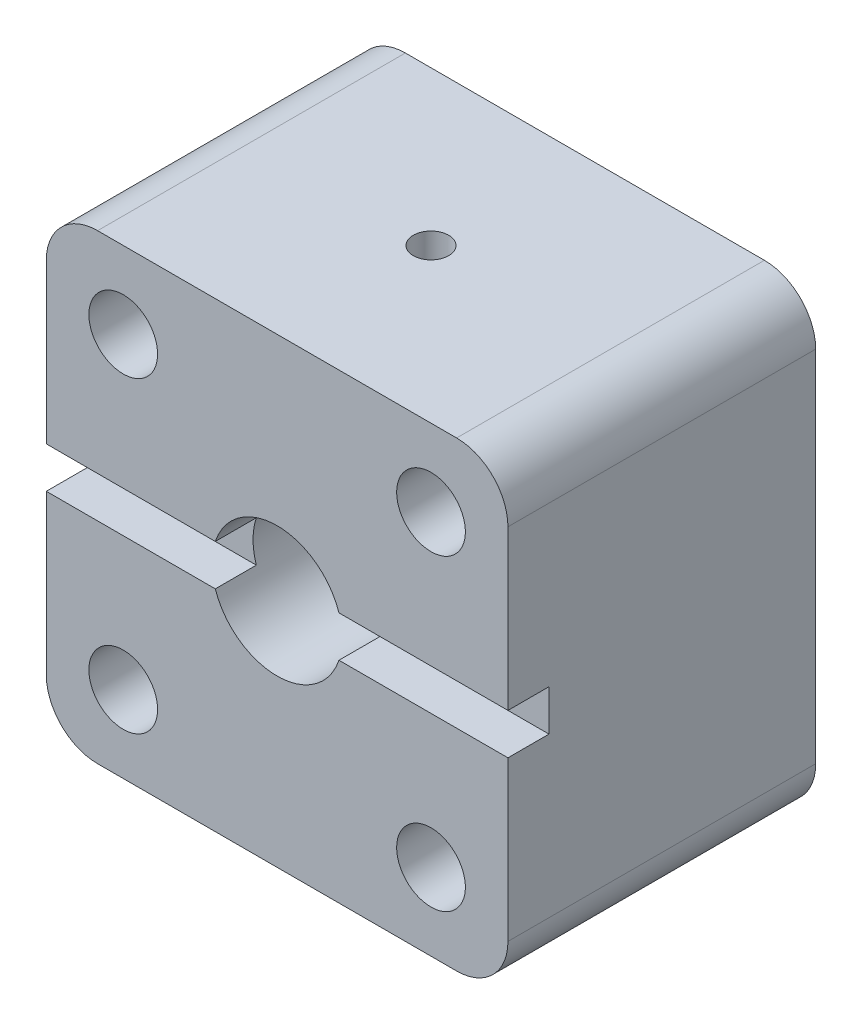
ISO-10303-21;
HEADER;
FILE_DESCRIPTION(('STEP AP214'),'2;1');
FILE_NAME('part.step','',(''),(''),'','','');
FILE_SCHEMA(('AUTOMOTIVE_DESIGN { 1 0 10303 214 1 1 1 1 }'));
ENDSEC;
DATA;
#1=APPLICATION_CONTEXT('core data for automotive mechanical design processes');
#2=APPLICATION_PROTOCOL_DEFINITION('international standard','automotive_design',2000,#1);
#3=PRODUCT_CONTEXT('',#1,'mechanical');
#4=PRODUCT('Part','Part','',(#3));
#5=PRODUCT_RELATED_PRODUCT_CATEGORY('part','',(#4));
#6=PRODUCT_DEFINITION_FORMATION('','',#4);
#7=PRODUCT_DEFINITION_CONTEXT('part definition',#1,'design');
#8=PRODUCT_DEFINITION('design','',#6,#7);
#9=PRODUCT_DEFINITION_SHAPE('','',#8);
#10=(LENGTH_UNIT() NAMED_UNIT(*) SI_UNIT(.MILLI.,.METRE.));
#11=(NAMED_UNIT(*) PLANE_ANGLE_UNIT() SI_UNIT($,.RADIAN.));
#12=(NAMED_UNIT(*) SI_UNIT($,.STERADIAN.) SOLID_ANGLE_UNIT());
#13=UNCERTAINTY_MEASURE_WITH_UNIT(LENGTH_MEASURE(1.E-05),#10,'distance_accuracy_value','');
#14=(GEOMETRIC_REPRESENTATION_CONTEXT(3) GLOBAL_UNCERTAINTY_ASSIGNED_CONTEXT((#13)) GLOBAL_UNIT_ASSIGNED_CONTEXT((#10,
#11,#12)) REPRESENTATION_CONTEXT('',''));
#15=CARTESIAN_POINT('',(0.,0.,0.));
#16=DIRECTION('',(0.,0.,1.));
#17=DIRECTION('',(1.,0.,0.));
#18=AXIS2_PLACEMENT_3D('',#15,#16,#17);
#19=CARTESIAN_POINT('',(0.,24.5,30.));
#20=DIRECTION('',(0.,1.,0.));
#21=DIRECTION('',(0.,0.,1.));
#22=AXIS2_PLACEMENT_3D('',#19,#20,#21);
#23=PLANE('',#22);
#24=DIRECTION('',(1.,0.,0.));
#25=VECTOR('',#24,1.);
#26=CARTESIAN_POINT('',(0.,24.5,30.));
#27=LINE('',#26,#25);
#28=CARTESIAN_POINT('',(28.5268150792935,24.5,30.));
#29=VERTEX_POINT('',#28);
#30=CARTESIAN_POINT('',(45.,24.5,30.));
#31=VERTEX_POINT('',#30);
#32=EDGE_CURVE('E182',#29,#31,#27,.T.);
#33=ORIENTED_EDGE('',*,*,#32,.F.);
#34=DIRECTION('',(0.,0.,-1.));
#35=VECTOR('',#34,1.);
#36=CARTESIAN_POINT('',(28.5268150792935,24.5,0.));
#37=LINE('',#36,#35);
#38=CARTESIAN_POINT('',(28.5268150792935,24.5,26.));
#39=VERTEX_POINT('',#38);
#40=EDGE_CURVE('E159',#29,#39,#37,.T.);
#41=ORIENTED_EDGE('',*,*,#40,.T.);
#42=DIRECTION('',(1.,0.,0.));
#43=VECTOR('',#42,1.);
#44=CARTESIAN_POINT('',(0.,24.5,26.));
#45=LINE('',#44,#43);
#46=CARTESIAN_POINT('',(45.,24.5,26.));
#47=VERTEX_POINT('',#46);
#48=EDGE_CURVE('E192',#39,#47,#45,.T.);
#49=ORIENTED_EDGE('',*,*,#48,.T.);
#50=DIRECTION('',(0.,0.,1.));
#51=VECTOR('',#50,1.);
#52=CARTESIAN_POINT('',(45.,24.5,30.));
#53=LINE('',#52,#51);
#54=EDGE_CURVE('E189',#47,#31,#53,.T.);
#55=ORIENTED_EDGE('',*,*,#54,.T.);
#56=EDGE_LOOP('',(#33,#41,#49,#55));
#57=FACE_BOUND('',#56,.T.);
#58=ADVANCED_FACE('F36',(#57),#23,.F.);
#59=CARTESIAN_POINT('',(0.,24.5,26.));
#60=DIRECTION('',(0.,0.,-1.));
#61=DIRECTION('',(0.,1.,0.));
#62=AXIS2_PLACEMENT_3D('',#59,#60,#61);
#63=PLANE('',#62);
#64=ORIENTED_EDGE('',*,*,#48,.F.);
#65=CARTESIAN_POINT('',(22.5,22.5,26.));
#66=DIRECTION('',(0.,0.,-1.));
#67=DIRECTION('',(0.,1.,0.));
#68=AXIS2_PLACEMENT_3D('',#65,#66,#67);
#69=CIRCLE('',#68,6.34999999999999);
#70=CARTESIAN_POINT('',(28.5268150792935,20.5,26.));
#71=VERTEX_POINT('',#70);
#72=EDGE_CURVE('E163',#39,#71,#69,.T.);
#73=ORIENTED_EDGE('',*,*,#72,.T.);
#74=DIRECTION('',(1.,0.,0.));
#75=VECTOR('',#74,1.);
#76=CARTESIAN_POINT('',(0.,20.5,26.));
#77=LINE('',#76,#75);
#78=CARTESIAN_POINT('',(45.,20.5,26.));
#79=VERTEX_POINT('',#78);
#80=EDGE_CURVE('E196',#71,#79,#77,.T.);
#81=ORIENTED_EDGE('',*,*,#80,.T.);
#82=DIRECTION('',(0.,1.,0.));
#83=VECTOR('',#82,1.);
#84=CARTESIAN_POINT('',(45.,24.5,26.));
#85=LINE('',#84,#83);
#86=EDGE_CURVE('E314',#79,#47,#85,.T.);
#87=ORIENTED_EDGE('',*,*,#86,.T.);
#88=EDGE_LOOP('',(#64,#73,#81,#87));
#89=FACE_BOUND('',#88,.T.);
#90=ADVANCED_FACE('F346',(#89),#63,.F.);
#91=CARTESIAN_POINT('',(0.,20.5,30.));
#92=DIRECTION('',(0.,-1.,0.));
#93=DIRECTION('',(0.,0.,-1.));
#94=AXIS2_PLACEMENT_3D('',#91,#92,#93);
#95=PLANE('',#94);
#96=DIRECTION('',(1.,0.,0.));
#97=VECTOR('',#96,1.);
#98=CARTESIAN_POINT('',(0.,20.5,30.));
#99=LINE('',#98,#97);
#100=CARTESIAN_POINT('',(0.,20.5,30.));
#101=VERTEX_POINT('',#100);
#102=CARTESIAN_POINT('',(16.4731849207065,20.5,30.));
#103=VERTEX_POINT('',#102);
#104=EDGE_CURVE('E197',#101,#103,#99,.T.);
#105=ORIENTED_EDGE('',*,*,#104,.T.);
#106=DIRECTION('',(0.,0.,-1.));
#107=VECTOR('',#106,1.);
#108=CARTESIAN_POINT('',(16.4731849207065,20.5,0.));
#109=LINE('',#108,#107);
#110=CARTESIAN_POINT('',(16.4731849207065,20.5,26.));
#111=VERTEX_POINT('',#110);
#112=EDGE_CURVE('E244',#103,#111,#109,.T.);
#113=ORIENTED_EDGE('',*,*,#112,.T.);
#114=CARTESIAN_POINT('',(0.,20.5,26.));
#115=VERTEX_POINT('',#114);
#116=EDGE_CURVE('E193',#115,#111,#77,.T.);
#117=ORIENTED_EDGE('',*,*,#116,.F.);
#118=DIRECTION('',(0.,0.,-1.));
#119=VECTOR('',#118,1.);
#120=CARTESIAN_POINT('',(0.,20.5,30.));
#121=LINE('',#120,#119);
#122=EDGE_CURVE('E308',#101,#115,#121,.T.);
#123=ORIENTED_EDGE('',*,*,#122,.F.);
#124=EDGE_LOOP('',(#105,#113,#117,#123));
#125=FACE_BOUND('',#124,.T.);
#126=ADVANCED_FACE('F340',(#125),#95,.F.);
#127=CARTESIAN_POINT('',(0.,0.,30.));
#128=DIRECTION('',(0.,0.,-1.));
#129=DIRECTION('',(-1.,0.,0.));
#130=AXIS2_PLACEMENT_3D('',#127,#128,#129);
#131=PLANE('',#130);
#132=CARTESIAN_POINT('',(37.5,37.5,30.));
#133=DIRECTION('',(0.,0.,-1.));
#134=DIRECTION('',(-1.,0.,0.));
#135=AXIS2_PLACEMENT_3D('',#132,#133,#134);
#136=CIRCLE('',#135,3.35);
#137=CARTESIAN_POINT('',(34.15,37.5,30.));
#138=VERTEX_POINT('',#137);
#139=EDGE_CURVE('E216',#138,#138,#136,.T.);
#140=ORIENTED_EDGE('',*,*,#139,.T.);
#141=EDGE_LOOP('',(#140));
#142=FACE_BOUND('',#141,.T.);
#143=CARTESIAN_POINT('',(7.50000000000001,37.5,30.));
#144=DIRECTION('',(0.,0.,-1.));
#145=DIRECTION('',(-1.,0.,0.));
#146=AXIS2_PLACEMENT_3D('',#143,#144,#145);
#147=CIRCLE('',#146,3.35);
#148=CARTESIAN_POINT('',(4.15000000000001,37.5,30.));
#149=VERTEX_POINT('',#148);
#150=EDGE_CURVE('E204',#149,#149,#147,.T.);
#151=ORIENTED_EDGE('',*,*,#150,.T.);
#152=EDGE_LOOP('',(#151));
#153=FACE_BOUND('',#152,.T.);
#154=DIRECTION('',(-1.,0.,0.));
#155=VECTOR('',#154,1.);
#156=CARTESIAN_POINT('',(0.,45.,30.));
#157=LINE('',#156,#155);
#158=CARTESIAN_POINT('',(40.,45.,30.));
#159=VERTEX_POINT('',#158);
#160=CARTESIAN_POINT('',(5.,45.,30.));
#161=VERTEX_POINT('',#160);
#162=EDGE_CURVE('E229',#159,#161,#157,.T.);
#163=ORIENTED_EDGE('',*,*,#162,.T.);
#164=CARTESIAN_POINT('',(5.,40.,30.));
#165=DIRECTION('',(0.,0.,-1.));
#166=DIRECTION('',(-1.,0.,0.));
#167=AXIS2_PLACEMENT_3D('',#164,#165,#166);
#168=CIRCLE('',#167,5.);
#169=CARTESIAN_POINT('',(0.,40.,30.));
#170=VERTEX_POINT('',#169);
#171=EDGE_CURVE('E267',#161,#170,#168,.F.);
#172=ORIENTED_EDGE('',*,*,#171,.T.);
#173=DIRECTION('',(0.,-1.,0.));
#174=VECTOR('',#173,1.);
#175=CARTESIAN_POINT('',(0.,0.,30.));
#176=LINE('',#175,#174);
#177=CARTESIAN_POINT('',(0.,24.5,30.));
#178=VERTEX_POINT('',#177);
#179=EDGE_CURVE('E180',#170,#178,#176,.T.);
#180=ORIENTED_EDGE('',*,*,#179,.T.);
#181=CARTESIAN_POINT('',(16.4731849207065,24.5,30.));
#182=VERTEX_POINT('',#181);
#183=EDGE_CURVE('E171',#178,#182,#27,.T.);
#184=ORIENTED_EDGE('',*,*,#183,.T.);
#185=CARTESIAN_POINT('',(22.5,22.5,30.));
#186=DIRECTION('',(0.,0.,-1.));
#187=DIRECTION('',(-1.,0.,0.));
#188=AXIS2_PLACEMENT_3D('',#185,#186,#187);
#189=CIRCLE('',#188,6.34999999999999);
#190=EDGE_CURVE('E153',#182,#29,#189,.T.);
#191=ORIENTED_EDGE('',*,*,#190,.T.);
#192=ORIENTED_EDGE('',*,*,#32,.T.);
#193=DIRECTION('',(0.,1.,0.));
#194=VECTOR('',#193,1.);
#195=CARTESIAN_POINT('',(45.,0.,30.));
#196=LINE('',#195,#194);
#197=CARTESIAN_POINT('',(45.,40.,30.));
#198=VERTEX_POINT('',#197);
#199=EDGE_CURVE('E226',#31,#198,#196,.T.);
#200=ORIENTED_EDGE('',*,*,#199,.T.);
#201=CARTESIAN_POINT('',(40.,40.,30.));
#202=DIRECTION('',(0.,0.,-1.));
#203=DIRECTION('',(-1.,0.,0.));
#204=AXIS2_PLACEMENT_3D('',#201,#202,#203);
#205=CIRCLE('',#204,5.);
#206=EDGE_CURVE('E265',#198,#159,#205,.F.);
#207=ORIENTED_EDGE('',*,*,#206,.T.);
#208=EDGE_LOOP('',(#163,#172,#180,#184,#191,#192,#200,#207));
#209=FACE_BOUND('',#208,.T.);
#210=ADVANCED_FACE('F178',(#142,#153,#209),#131,.F.);
#211=CARTESIAN_POINT('',(0.,0.,30.));
#212=DIRECTION('',(1.,0.,0.));
#213=DIRECTION('',(0.,0.,-1.));
#214=AXIS2_PLACEMENT_3D('',#211,#212,#213);
#215=PLANE('',#214);
#216=ORIENTED_EDGE('',*,*,#179,.F.);
#217=DIRECTION('',(0.,0.,-1.));
#218=VECTOR('',#217,1.);
#219=CARTESIAN_POINT('',(0.,40.,30.));
#220=LINE('',#219,#218);
#221=CARTESIAN_POINT('',(0.,40.,0.));
#222=VERTEX_POINT('',#221);
#223=EDGE_CURVE('E249',#170,#222,#220,.T.);
#224=ORIENTED_EDGE('',*,*,#223,.T.);
#225=DIRECTION('',(0.,-1.,0.));
#226=VECTOR('',#225,1.);
#227=CARTESIAN_POINT('',(0.,0.,0.));
#228=LINE('',#227,#226);
#229=CARTESIAN_POINT('',(0.,5.,0.));
#230=VERTEX_POINT('',#229);
#231=EDGE_CURVE('E219',#222,#230,#228,.T.);
#232=ORIENTED_EDGE('',*,*,#231,.T.);
#233=DIRECTION('',(0.,0.,-1.));
#234=VECTOR('',#233,1.);
#235=CARTESIAN_POINT('',(0.,5.,30.));
#236=LINE('',#235,#234);
#237=CARTESIAN_POINT('',(0.,5.,30.));
#238=VERTEX_POINT('',#237);
#239=EDGE_CURVE('E247',#230,#238,#236,.F.);
#240=ORIENTED_EDGE('',*,*,#239,.T.);
#241=EDGE_CURVE('E224',#101,#238,#176,.T.);
#242=ORIENTED_EDGE('',*,*,#241,.F.);
#243=ORIENTED_EDGE('',*,*,#122,.T.);
#244=DIRECTION('',(0.,1.,0.));
#245=VECTOR('',#244,1.);
#246=CARTESIAN_POINT('',(0.,24.5,26.));
#247=LINE('',#246,#245);
#248=CARTESIAN_POINT('',(0.,24.5,26.));
#249=VERTEX_POINT('',#248);
#250=EDGE_CURVE('E305',#115,#249,#247,.T.);
#251=ORIENTED_EDGE('',*,*,#250,.T.);
#252=DIRECTION('',(0.,0.,1.));
#253=VECTOR('',#252,1.);
#254=CARTESIAN_POINT('',(0.,24.5,30.));
#255=LINE('',#254,#253);
#256=EDGE_CURVE('E302',#249,#178,#255,.T.);
#257=ORIENTED_EDGE('',*,*,#256,.T.);
#258=EDGE_LOOP('',(#216,#224,#232,#240,#242,#243,#251,#257));
#259=FACE_BOUND('',#258,.T.);
#260=ADVANCED_FACE('F299',(#259),#215,.F.);
#261=CARTESIAN_POINT('',(0.,0.,30.));
#262=DIRECTION('',(0.,1.,0.));
#263=DIRECTION('',(0.,0.,1.));
#264=AXIS2_PLACEMENT_3D('',#261,#262,#263);
#265=PLANE('',#264);
#266=DIRECTION('',(1.,0.,0.));
#267=VECTOR('',#266,1.);
#268=CARTESIAN_POINT('',(0.,0.,30.));
#269=LINE('',#268,#267);
#270=CARTESIAN_POINT('',(5.,0.,30.));
#271=VERTEX_POINT('',#270);
#272=CARTESIAN_POINT('',(40.,0.,30.));
#273=VERTEX_POINT('',#272);
#274=EDGE_CURVE('E223',#271,#273,#269,.T.);
#275=ORIENTED_EDGE('',*,*,#274,.F.);
#276=DIRECTION('',(0.,0.,-1.));
#277=VECTOR('',#276,1.);
#278=CARTESIAN_POINT('',(5.,0.,30.));
#279=LINE('',#278,#277);
#280=CARTESIAN_POINT('',(5.,0.,0.));
#281=VERTEX_POINT('',#280);
#282=EDGE_CURVE('E270',#271,#281,#279,.T.);
#283=ORIENTED_EDGE('',*,*,#282,.T.);
#284=DIRECTION('',(1.,0.,0.));
#285=VECTOR('',#284,1.);
#286=CARTESIAN_POINT('',(0.,0.,0.));
#287=LINE('',#286,#285);
#288=CARTESIAN_POINT('',(40.,0.,0.));
#289=VERTEX_POINT('',#288);
#290=EDGE_CURVE('E234',#281,#289,#287,.T.);
#291=ORIENTED_EDGE('',*,*,#290,.T.);
#292=DIRECTION('',(0.,0.,-1.));
#293=VECTOR('',#292,1.);
#294=CARTESIAN_POINT('',(40.,0.,30.));
#295=LINE('',#294,#293);
#296=EDGE_CURVE('E59',#289,#273,#295,.F.);
#297=ORIENTED_EDGE('',*,*,#296,.T.);
#298=EDGE_LOOP('',(#275,#283,#291,#297));
#299=FACE_BOUND('',#298,.T.);
#300=ADVANCED_FACE('F390',(#299),#265,.F.);
#301=CARTESIAN_POINT('',(45.,0.,30.));
#302=DIRECTION('',(-1.,0.,0.));
#303=DIRECTION('',(0.,0.,1.));
#304=AXIS2_PLACEMENT_3D('',#301,#302,#303);
#305=PLANE('',#304);
#306=CARTESIAN_POINT('',(45.,5.,30.));
#307=VERTEX_POINT('',#306);
#308=CARTESIAN_POINT('',(45.,20.5,30.));
#309=VERTEX_POINT('',#308);
#310=EDGE_CURVE('E227',#307,#309,#196,.T.);
#311=ORIENTED_EDGE('',*,*,#310,.F.);
#312=DIRECTION('',(0.,0.,-1.));
#313=VECTOR('',#312,1.);
#314=CARTESIAN_POINT('',(45.,5.,30.));
#315=LINE('',#314,#313);
#316=CARTESIAN_POINT('',(45.,5.,0.));
#317=VERTEX_POINT('',#316);
#318=EDGE_CURVE('E11',#307,#317,#315,.T.);
#319=ORIENTED_EDGE('',*,*,#318,.T.);
#320=DIRECTION('',(0.,1.,0.));
#321=VECTOR('',#320,1.);
#322=CARTESIAN_POINT('',(45.,0.,0.));
#323=LINE('',#322,#321);
#324=CARTESIAN_POINT('',(45.,40.,0.));
#325=VERTEX_POINT('',#324);
#326=EDGE_CURVE('E236',#317,#325,#323,.T.);
#327=ORIENTED_EDGE('',*,*,#326,.T.);
#328=DIRECTION('',(0.,0.,-1.));
#329=VECTOR('',#328,1.);
#330=CARTESIAN_POINT('',(45.,40.,30.));
#331=LINE('',#330,#329);
#332=EDGE_CURVE('E44',#325,#198,#331,.F.);
#333=ORIENTED_EDGE('',*,*,#332,.T.);
#334=ORIENTED_EDGE('',*,*,#199,.F.);
#335=ORIENTED_EDGE('',*,*,#54,.F.);
#336=ORIENTED_EDGE('',*,*,#86,.F.);
#337=DIRECTION('',(0.,0.,-1.));
#338=VECTOR('',#337,1.);
#339=CARTESIAN_POINT('',(45.,20.5,30.));
#340=LINE('',#339,#338);
#341=EDGE_CURVE('E312',#309,#79,#340,.T.);
#342=ORIENTED_EDGE('',*,*,#341,.F.);
#343=EDGE_LOOP('',(#311,#319,#327,#333,#334,#335,#336,#342));
#344=FACE_BOUND('',#343,.T.);
#345=ADVANCED_FACE('F279',(#344),#305,.F.);
#346=CARTESIAN_POINT('',(0.,45.,30.));
#347=DIRECTION('',(0.,-1.,0.));
#348=DIRECTION('',(0.,0.,-1.));
#349=AXIS2_PLACEMENT_3D('',#346,#347,#348);
#350=PLANE('',#349);
#351=CARTESIAN_POINT('',(22.5,45.,15.));
#352=DIRECTION('',(0.,1.,0.));
#353=DIRECTION('',(0.,0.,1.));
#354=AXIS2_PLACEMENT_3D('',#351,#352,#353);
#355=CIRCLE('',#354,1.7272);
#356=CARTESIAN_POINT('',(22.5,45.,16.7272));
#357=VERTEX_POINT('',#356);
#358=EDGE_CURVE('E174',#357,#357,#355,.T.);
#359=ORIENTED_EDGE('',*,*,#358,.F.);
#360=EDGE_LOOP('',(#359));
#361=FACE_BOUND('',#360,.T.);
#362=DIRECTION('',(-1.,0.,0.));
#363=VECTOR('',#362,1.);
#364=CARTESIAN_POINT('',(0.,45.,0.));
#365=LINE('',#364,#363);
#366=CARTESIAN_POINT('',(40.,45.,0.));
#367=VERTEX_POINT('',#366);
#368=CARTESIAN_POINT('',(5.,45.,0.));
#369=VERTEX_POINT('',#368);
#370=EDGE_CURVE('E239',#367,#369,#365,.T.);
#371=ORIENTED_EDGE('',*,*,#370,.T.);
#372=DIRECTION('',(0.,0.,-1.));
#373=VECTOR('',#372,1.);
#374=CARTESIAN_POINT('',(5.,45.,30.));
#375=LINE('',#374,#373);
#376=EDGE_CURVE('E263',#369,#161,#375,.F.);
#377=ORIENTED_EDGE('',*,*,#376,.T.);
#378=ORIENTED_EDGE('',*,*,#162,.F.);
#379=DIRECTION('',(0.,0.,-1.));
#380=VECTOR('',#379,1.);
#381=CARTESIAN_POINT('',(40.,45.,30.));
#382=LINE('',#381,#380);
#383=EDGE_CURVE('E260',#159,#367,#382,.T.);
#384=ORIENTED_EDGE('',*,*,#383,.T.);
#385=EDGE_LOOP('',(#371,#377,#378,#384));
#386=FACE_BOUND('',#385,.T.);
#387=ADVANCED_FACE('F289',(#361,#386),#350,.F.);
#388=CARTESIAN_POINT('',(37.5,7.5,30.));
#389=DIRECTION('',(0.,0.,-1.));
#390=DIRECTION('',(-1.,0.,0.));
#391=AXIS2_PLACEMENT_3D('',#388,#389,#390);
#392=CIRCLE('',#391,3.35);
#393=CARTESIAN_POINT('',(34.15,7.5,30.));
#394=VERTEX_POINT('',#393);
#395=EDGE_CURVE('E211',#394,#394,#392,.T.);
#396=ORIENTED_EDGE('',*,*,#395,.T.);
#397=EDGE_LOOP('',(#396));
#398=FACE_BOUND('',#397,.T.);
#399=CARTESIAN_POINT('',(7.5,7.5,30.));
#400=DIRECTION('',(0.,0.,-1.));
#401=DIRECTION('',(-1.,0.,0.));
#402=AXIS2_PLACEMENT_3D('',#399,#400,#401);
#403=CIRCLE('',#402,3.35);
#404=CARTESIAN_POINT('',(4.15,7.5,30.));
#405=VERTEX_POINT('',#404);
#406=EDGE_CURVE('E185',#405,#405,#403,.T.);
#407=ORIENTED_EDGE('',*,*,#406,.T.);
#408=EDGE_LOOP('',(#407));
#409=FACE_BOUND('',#408,.T.);
#410=ORIENTED_EDGE('',*,*,#241,.T.);
#411=CARTESIAN_POINT('',(5.,5.,30.));
#412=DIRECTION('',(0.,0.,-1.));
#413=DIRECTION('',(-1.,0.,0.));
#414=AXIS2_PLACEMENT_3D('',#411,#412,#413);
#415=CIRCLE('',#414,5.);
#416=EDGE_CURVE('E274',#238,#271,#415,.F.);
#417=ORIENTED_EDGE('',*,*,#416,.T.);
#418=ORIENTED_EDGE('',*,*,#274,.T.);
#419=CARTESIAN_POINT('',(40.,5.,30.));
#420=DIRECTION('',(0.,0.,-1.));
#421=DIRECTION('',(-1.,0.,0.));
#422=AXIS2_PLACEMENT_3D('',#419,#420,#421);
#423=CIRCLE('',#422,5.);
#424=EDGE_CURVE('E51',#273,#307,#423,.F.);
#425=ORIENTED_EDGE('',*,*,#424,.T.);
#426=ORIENTED_EDGE('',*,*,#310,.T.);
#427=CARTESIAN_POINT('',(28.5268150792935,20.5,30.));
#428=VERTEX_POINT('',#427);
#429=EDGE_CURVE('E200',#428,#309,#99,.T.);
#430=ORIENTED_EDGE('',*,*,#429,.F.);
#431=EDGE_CURVE('E164',#428,#103,#189,.T.);
#432=ORIENTED_EDGE('',*,*,#431,.T.);
#433=ORIENTED_EDGE('',*,*,#104,.F.);
#434=EDGE_LOOP('',(#410,#417,#418,#425,#426,#430,#432,#433));
#435=FACE_BOUND('',#434,.T.);
#436=ADVANCED_FACE('F338',(#398,#409,#435),#131,.F.);
#437=CARTESIAN_POINT('',(0.,0.,0.));
#438=DIRECTION('',(0.,0.,-1.));
#439=DIRECTION('',(-1.,0.,0.));
#440=AXIS2_PLACEMENT_3D('',#437,#438,#439);
#441=PLANE('',#440);
#442=CARTESIAN_POINT('',(22.5,22.5,0.));
#443=DIRECTION('',(0.,0.,-1.));
#444=DIRECTION('',(-1.,0.,0.));
#445=AXIS2_PLACEMENT_3D('',#442,#443,#444);
#446=CIRCLE('',#445,6.34999999999999);
#447=CARTESIAN_POINT('',(16.15,22.5,0.));
#448=VERTEX_POINT('',#447);
#449=EDGE_CURVE('E330',#448,#448,#446,.T.);
#450=ORIENTED_EDGE('',*,*,#449,.F.);
#451=EDGE_LOOP('',(#450));
#452=FACE_BOUND('',#451,.T.);
#453=CARTESIAN_POINT('',(7.50000000000001,37.5,0.));
#454=DIRECTION('',(0.,0.,-1.));
#455=DIRECTION('',(-1.,0.,0.));
#456=AXIS2_PLACEMENT_3D('',#453,#454,#455);
#457=CIRCLE('',#456,3.35);
#458=CARTESIAN_POINT('',(4.15000000000001,37.5,0.));
#459=VERTEX_POINT('',#458);
#460=EDGE_CURVE('E208',#459,#459,#457,.T.);
#461=ORIENTED_EDGE('',*,*,#460,.F.);
#462=EDGE_LOOP('',(#461));
#463=FACE_BOUND('',#462,.T.);
#464=CARTESIAN_POINT('',(37.5,7.5,0.));
#465=DIRECTION('',(0.,0.,-1.));
#466=DIRECTION('',(-1.,0.,0.));
#467=AXIS2_PLACEMENT_3D('',#464,#465,#466);
#468=CIRCLE('',#467,3.35);
#469=CARTESIAN_POINT('',(34.15,7.5,0.));
#470=VERTEX_POINT('',#469);
#471=EDGE_CURVE('E202',#470,#470,#468,.T.);
#472=ORIENTED_EDGE('',*,*,#471,.F.);
#473=EDGE_LOOP('',(#472));
#474=FACE_BOUND('',#473,.T.);
#475=CARTESIAN_POINT('',(7.5,7.5,0.));
#476=DIRECTION('',(0.,0.,-1.));
#477=DIRECTION('',(-1.,0.,0.));
#478=AXIS2_PLACEMENT_3D('',#475,#476,#477);
#479=CIRCLE('',#478,3.35);
#480=CARTESIAN_POINT('',(4.15,7.5,0.));
#481=VERTEX_POINT('',#480);
#482=EDGE_CURVE('E181',#481,#481,#479,.T.);
#483=ORIENTED_EDGE('',*,*,#482,.F.);
#484=EDGE_LOOP('',(#483));
#485=FACE_BOUND('',#484,.T.);
#486=CARTESIAN_POINT('',(37.5,37.5,0.));
#487=DIRECTION('',(0.,0.,-1.));
#488=DIRECTION('',(-1.,0.,0.));
#489=AXIS2_PLACEMENT_3D('',#486,#487,#488);
#490=CIRCLE('',#489,3.35);
#491=CARTESIAN_POINT('',(34.15,37.5,0.));
#492=VERTEX_POINT('',#491);
#493=EDGE_CURVE('E207',#492,#492,#490,.T.);
#494=ORIENTED_EDGE('',*,*,#493,.F.);
#495=EDGE_LOOP('',(#494));
#496=FACE_BOUND('',#495,.T.);
#497=ORIENTED_EDGE('',*,*,#231,.F.);
#498=CARTESIAN_POINT('',(5.,40.,0.));
#499=DIRECTION('',(0.,0.,-1.));
#500=DIRECTION('',(-1.,0.,0.));
#501=AXIS2_PLACEMENT_3D('',#498,#499,#500);
#502=CIRCLE('',#501,5.);
#503=EDGE_CURVE('E258',#222,#369,#502,.T.);
#504=ORIENTED_EDGE('',*,*,#503,.T.);
#505=ORIENTED_EDGE('',*,*,#370,.F.);
#506=CARTESIAN_POINT('',(40.,40.,0.));
#507=DIRECTION('',(0.,0.,-1.));
#508=DIRECTION('',(-1.,0.,0.));
#509=AXIS2_PLACEMENT_3D('',#506,#507,#508);
#510=CIRCLE('',#509,5.);
#511=EDGE_CURVE('E252',#367,#325,#510,.T.);
#512=ORIENTED_EDGE('',*,*,#511,.T.);
#513=ORIENTED_EDGE('',*,*,#326,.F.);
#514=CARTESIAN_POINT('',(40.,5.,0.));
#515=DIRECTION('',(0.,0.,-1.));
#516=DIRECTION('',(-1.,0.,0.));
#517=AXIS2_PLACEMENT_3D('',#514,#515,#516);
#518=CIRCLE('',#517,5.);
#519=EDGE_CURVE('E254',#317,#289,#518,.T.);
#520=ORIENTED_EDGE('',*,*,#519,.T.);
#521=ORIENTED_EDGE('',*,*,#290,.F.);
#522=CARTESIAN_POINT('',(5.,5.,0.));
#523=DIRECTION('',(0.,0.,-1.));
#524=DIRECTION('',(-1.,0.,0.));
#525=AXIS2_PLACEMENT_3D('',#522,#523,#524);
#526=CIRCLE('',#525,5.);
#527=EDGE_CURVE('E256',#281,#230,#526,.T.);
#528=ORIENTED_EDGE('',*,*,#527,.T.);
#529=EDGE_LOOP('',(#497,#504,#505,#512,#513,#520,#521,#528));
#530=FACE_BOUND('',#529,.T.);
#531=ADVANCED_FACE('F293',(#452,#463,#474,#485,#496,#530),#441,.T.);
#532=CARTESIAN_POINT('',(37.5,37.5,30.));
#533=DIRECTION('',(0.,0.,-1.));
#534=DIRECTION('',(-1.,0.,0.));
#535=AXIS2_PLACEMENT_3D('',#532,#533,#534);
#536=CYLINDRICAL_SURFACE('',#535,3.35);
#537=ORIENTED_EDGE('',*,*,#139,.F.);
#538=EDGE_LOOP('',(#537));
#539=FACE_BOUND('',#538,.T.);
#540=ORIENTED_EDGE('',*,*,#493,.T.);
#541=EDGE_LOOP('',(#540));
#542=FACE_BOUND('',#541,.T.);
#543=ADVANCED_FACE('F405',(#539,#542),#536,.F.);
#544=CARTESIAN_POINT('',(7.5,7.5,30.));
#545=DIRECTION('',(0.,0.,-1.));
#546=DIRECTION('',(-1.,0.,0.));
#547=AXIS2_PLACEMENT_3D('',#544,#545,#546);
#548=CYLINDRICAL_SURFACE('',#547,3.35);
#549=ORIENTED_EDGE('',*,*,#406,.F.);
#550=EDGE_LOOP('',(#549));
#551=FACE_BOUND('',#550,.T.);
#552=ORIENTED_EDGE('',*,*,#482,.T.);
#553=EDGE_LOOP('',(#552));
#554=FACE_BOUND('',#553,.T.);
#555=ADVANCED_FACE('F412',(#551,#554),#548,.F.);
#556=CARTESIAN_POINT('',(37.5,7.5,30.));
#557=DIRECTION('',(0.,0.,-1.));
#558=DIRECTION('',(-1.,0.,0.));
#559=AXIS2_PLACEMENT_3D('',#556,#557,#558);
#560=CYLINDRICAL_SURFACE('',#559,3.35);
#561=ORIENTED_EDGE('',*,*,#395,.F.);
#562=EDGE_LOOP('',(#561));
#563=FACE_BOUND('',#562,.T.);
#564=ORIENTED_EDGE('',*,*,#471,.T.);
#565=EDGE_LOOP('',(#564));
#566=FACE_BOUND('',#565,.T.);
#567=ADVANCED_FACE('F414',(#563,#566),#560,.F.);
#568=CARTESIAN_POINT('',(7.50000000000001,37.5,30.));
#569=DIRECTION('',(0.,0.,-1.));
#570=DIRECTION('',(-1.,0.,0.));
#571=AXIS2_PLACEMENT_3D('',#568,#569,#570);
#572=CYLINDRICAL_SURFACE('',#571,3.35);
#573=ORIENTED_EDGE('',*,*,#150,.F.);
#574=EDGE_LOOP('',(#573));
#575=FACE_BOUND('',#574,.T.);
#576=ORIENTED_EDGE('',*,*,#460,.T.);
#577=EDGE_LOOP('',(#576));
#578=FACE_BOUND('',#577,.T.);
#579=ADVANCED_FACE('F354',(#575,#578),#572,.F.);
#580=CARTESIAN_POINT('',(16.4731849207065,24.5,26.));
#581=VERTEX_POINT('',#580);
#582=EDGE_CURVE('E173',#249,#581,#45,.T.);
#583=ORIENTED_EDGE('',*,*,#582,.T.);
#584=DIRECTION('',(0.,0.,-1.));
#585=VECTOR('',#584,1.);
#586=CARTESIAN_POINT('',(16.4731849207065,24.5,0.));
#587=LINE('',#586,#585);
#588=EDGE_CURVE('E156',#581,#182,#587,.F.);
#589=ORIENTED_EDGE('',*,*,#588,.T.);
#590=ORIENTED_EDGE('',*,*,#183,.F.);
#591=ORIENTED_EDGE('',*,*,#256,.F.);
#592=EDGE_LOOP('',(#583,#589,#590,#591));
#593=FACE_BOUND('',#592,.T.);
#594=ADVANCED_FACE('F169',(#593),#23,.F.);
#595=ORIENTED_EDGE('',*,*,#116,.T.);
#596=EDGE_CURVE('E175',#111,#581,#69,.T.);
#597=ORIENTED_EDGE('',*,*,#596,.T.);
#598=ORIENTED_EDGE('',*,*,#582,.F.);
#599=ORIENTED_EDGE('',*,*,#250,.F.);
#600=EDGE_LOOP('',(#595,#597,#598,#599));
#601=FACE_BOUND('',#600,.T.);
#602=ADVANCED_FACE('F342',(#601),#63,.F.);
#603=ORIENTED_EDGE('',*,*,#80,.F.);
#604=DIRECTION('',(0.,0.,-1.));
#605=VECTOR('',#604,1.);
#606=CARTESIAN_POINT('',(28.5268150792935,20.5,0.));
#607=LINE('',#606,#605);
#608=EDGE_CURVE('E231',#71,#428,#607,.F.);
#609=ORIENTED_EDGE('',*,*,#608,.T.);
#610=ORIENTED_EDGE('',*,*,#429,.T.);
#611=ORIENTED_EDGE('',*,*,#341,.T.);
#612=EDGE_LOOP('',(#603,#609,#610,#611));
#613=FACE_BOUND('',#612,.T.);
#614=ADVANCED_FACE('F344',(#613),#95,.F.);
#615=CARTESIAN_POINT('',(22.5,35.,15.));
#616=DIRECTION('',(0.,1.,0.));
#617=DIRECTION('',(0.,0.,1.));
#618=AXIS2_PLACEMENT_3D('',#615,#616,#617);
#619=CONICAL_SURFACE('',#618,1.7272,1.02974425867665);
#620=CARTESIAN_POINT('',(22.5,33.9621935388156,15.));
#621=VERTEX_POINT('',#620);
#622=VERTEX_LOOP('',#621);
#623=FACE_BOUND('',#622,.T.);
#624=CARTESIAN_POINT('',(22.5,35.,15.));
#625=DIRECTION('',(0.,1.,0.));
#626=DIRECTION('',(0.,0.,1.));
#627=AXIS2_PLACEMENT_3D('',#624,#625,#626);
#628=CIRCLE('',#627,1.7272);
#629=CARTESIAN_POINT('',(22.5,35.,16.7272));
#630=VERTEX_POINT('',#629);
#631=EDGE_CURVE('E315',#630,#630,#628,.T.);
#632=ORIENTED_EDGE('',*,*,#631,.T.);
#633=EDGE_LOOP('',(#632));
#634=FACE_BOUND('',#633,.T.);
#635=ADVANCED_FACE('F351',(#623,#634),#619,.F.);
#636=CARTESIAN_POINT('',(22.5,45.,15.));
#637=DIRECTION('',(0.,1.,0.));
#638=DIRECTION('',(0.,0.,1.));
#639=AXIS2_PLACEMENT_3D('',#636,#637,#638);
#640=CYLINDRICAL_SURFACE('',#639,1.7272);
#641=ORIENTED_EDGE('',*,*,#631,.F.);
#642=EDGE_LOOP('',(#641));
#643=FACE_BOUND('',#642,.T.);
#644=ORIENTED_EDGE('',*,*,#358,.T.);
#645=EDGE_LOOP('',(#644));
#646=FACE_BOUND('',#645,.T.);
#647=ADVANCED_FACE('F363',(#643,#646),#640,.F.);
#648=CARTESIAN_POINT('',(22.5,22.5,0.));
#649=DIRECTION('',(0.,0.,-1.));
#650=DIRECTION('',(-1.,0.,0.));
#651=AXIS2_PLACEMENT_3D('',#648,#649,#650);
#652=CYLINDRICAL_SURFACE('',#651,6.34999999999999);
#653=ORIENTED_EDGE('',*,*,#449,.T.);
#654=EDGE_LOOP('',(#653));
#655=FACE_BOUND('',#654,.T.);
#656=ORIENTED_EDGE('',*,*,#596,.F.);
#657=ORIENTED_EDGE('',*,*,#112,.F.);
#658=ORIENTED_EDGE('',*,*,#431,.F.);
#659=ORIENTED_EDGE('',*,*,#608,.F.);
#660=ORIENTED_EDGE('',*,*,#72,.F.);
#661=ORIENTED_EDGE('',*,*,#40,.F.);
#662=ORIENTED_EDGE('',*,*,#190,.F.);
#663=ORIENTED_EDGE('',*,*,#588,.F.);
#664=EDGE_LOOP('',(#656,#657,#658,#659,#660,#661,#662,#663));
#665=FACE_BOUND('',#664,.T.);
#666=ADVANCED_FACE('F155',(#655,#665),#652,.F.);
#667=CARTESIAN_POINT('',(5.,40.,30.));
#668=DIRECTION('',(0.,0.,-1.));
#669=DIRECTION('',(-1.,0.,0.));
#670=AXIS2_PLACEMENT_3D('',#667,#668,#669);
#671=CYLINDRICAL_SURFACE('',#670,5.);
#672=ORIENTED_EDGE('',*,*,#171,.F.);
#673=ORIENTED_EDGE('',*,*,#376,.F.);
#674=ORIENTED_EDGE('',*,*,#503,.F.);
#675=ORIENTED_EDGE('',*,*,#223,.F.);
#676=EDGE_LOOP('',(#672,#673,#674,#675));
#677=FACE_BOUND('',#676,.T.);
#678=ADVANCED_FACE('F297',(#677),#671,.T.);
#679=CARTESIAN_POINT('',(5.,5.,30.));
#680=DIRECTION('',(0.,0.,-1.));
#681=DIRECTION('',(-1.,0.,0.));
#682=AXIS2_PLACEMENT_3D('',#679,#680,#681);
#683=CYLINDRICAL_SURFACE('',#682,5.);
#684=ORIENTED_EDGE('',*,*,#416,.F.);
#685=ORIENTED_EDGE('',*,*,#239,.F.);
#686=ORIENTED_EDGE('',*,*,#527,.F.);
#687=ORIENTED_EDGE('',*,*,#282,.F.);
#688=EDGE_LOOP('',(#684,#685,#686,#687));
#689=FACE_BOUND('',#688,.T.);
#690=ADVANCED_FACE('F372',(#689),#683,.T.);
#691=CARTESIAN_POINT('',(40.,5.,30.));
#692=DIRECTION('',(0.,0.,-1.));
#693=DIRECTION('',(-1.,0.,0.));
#694=AXIS2_PLACEMENT_3D('',#691,#692,#693);
#695=CYLINDRICAL_SURFACE('',#694,5.);
#696=ORIENTED_EDGE('',*,*,#424,.F.);
#697=ORIENTED_EDGE('',*,*,#296,.F.);
#698=ORIENTED_EDGE('',*,*,#519,.F.);
#699=ORIENTED_EDGE('',*,*,#318,.F.);
#700=EDGE_LOOP('',(#696,#697,#698,#699));
#701=FACE_BOUND('',#700,.T.);
#702=ADVANCED_FACE('F377',(#701),#695,.T.);
#703=CARTESIAN_POINT('',(40.,40.,30.));
#704=DIRECTION('',(0.,0.,-1.));
#705=DIRECTION('',(-1.,0.,0.));
#706=AXIS2_PLACEMENT_3D('',#703,#704,#705);
#707=CYLINDRICAL_SURFACE('',#706,5.);
#708=ORIENTED_EDGE('',*,*,#206,.F.);
#709=ORIENTED_EDGE('',*,*,#332,.F.);
#710=ORIENTED_EDGE('',*,*,#511,.F.);
#711=ORIENTED_EDGE('',*,*,#383,.F.);
#712=EDGE_LOOP('',(#708,#709,#710,#711));
#713=FACE_BOUND('',#712,.T.);
#714=ADVANCED_FACE('F38',(#713),#707,.T.);
#715=CLOSED_SHELL('',(#58,#90,#126,#210,#260,#300,#345,#387,#436,#531,#543,#555,#567,#579,#594,
#602,#614,#635,#647,#666,#678,#690,#702,#714));
#716=MANIFOLD_SOLID_BREP('B2',#715);
#717=ADVANCED_BREP_SHAPE_REPRESENTATION('',(#18,#716),#14);
#718=SHAPE_DEFINITION_REPRESENTATION(#9,#717);
ENDSEC;
END-ISO-10303-21;
